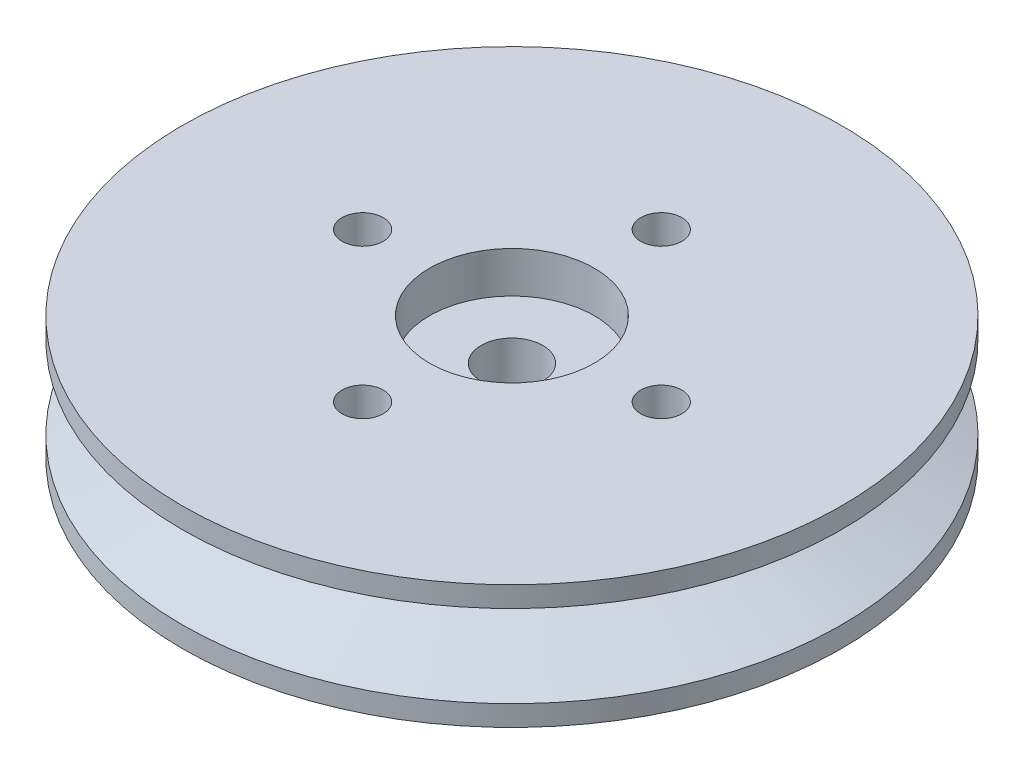
ISO-10303-21;
HEADER;
FILE_DESCRIPTION(('STEP AP214'),'2;1');
FILE_NAME('part.step','',(''),(''),'','','');
FILE_SCHEMA(('AUTOMOTIVE_DESIGN { 1 0 10303 214 1 1 1 1 }'));
ENDSEC;
DATA;
#1=APPLICATION_CONTEXT('core data for automotive mechanical design processes');
#2=APPLICATION_PROTOCOL_DEFINITION('international standard','automotive_design',2000,#1);
#3=PRODUCT_CONTEXT('',#1,'mechanical');
#4=PRODUCT('Part','Part','',(#3));
#5=PRODUCT_RELATED_PRODUCT_CATEGORY('part','',(#4));
#6=PRODUCT_DEFINITION_FORMATION('','',#4);
#7=PRODUCT_DEFINITION_CONTEXT('part definition',#1,'design');
#8=PRODUCT_DEFINITION('design','',#6,#7);
#9=PRODUCT_DEFINITION_SHAPE('','',#8);
#10=(LENGTH_UNIT() NAMED_UNIT(*) SI_UNIT(.MILLI.,.METRE.));
#11=(NAMED_UNIT(*) PLANE_ANGLE_UNIT() SI_UNIT($,.RADIAN.));
#12=(NAMED_UNIT(*) SI_UNIT($,.STERADIAN.) SOLID_ANGLE_UNIT());
#13=UNCERTAINTY_MEASURE_WITH_UNIT(LENGTH_MEASURE(1.E-05),#10,'distance_accuracy_value','');
#14=(GEOMETRIC_REPRESENTATION_CONTEXT(3) GLOBAL_UNCERTAINTY_ASSIGNED_CONTEXT((#13)) GLOBAL_UNIT_ASSIGNED_CONTEXT((#10,
#11,#12)) REPRESENTATION_CONTEXT('',''));
#15=CARTESIAN_POINT('',(0.,0.,0.));
#16=DIRECTION('',(0.,0.,1.));
#17=DIRECTION('',(1.,0.,0.));
#18=AXIS2_PLACEMENT_3D('',#15,#16,#17);
#19=CARTESIAN_POINT('',(0.,6.,0.));
#20=DIRECTION('',(0.,-1.,0.));
#21=DIRECTION('',(0.,0.,-1.));
#22=AXIS2_PLACEMENT_3D('',#19,#20,#21);
#23=CYLINDRICAL_SURFACE('',#22,16.);
#24=CARTESIAN_POINT('',(0.,5.,0.));
#25=DIRECTION('',(0.,1.,0.));
#26=DIRECTION('',(0.,0.,1.));
#27=AXIS2_PLACEMENT_3D('',#24,#25,#26);
#28=CIRCLE('',#27,16.);
#29=CARTESIAN_POINT('',(0.,5.,16.));
#30=VERTEX_POINT('',#29);
#31=EDGE_CURVE('E76',#30,#30,#28,.T.);
#32=ORIENTED_EDGE('',*,*,#31,.T.);
#33=EDGE_LOOP('',(#32));
#34=FACE_BOUND('',#33,.T.);
#35=CARTESIAN_POINT('',(0.,6.,0.));
#36=DIRECTION('',(0.,1.,0.));
#37=DIRECTION('',(0.,0.,1.));
#38=AXIS2_PLACEMENT_3D('',#35,#36,#37);
#39=CIRCLE('',#38,16.);
#40=CARTESIAN_POINT('',(0.,6.,16.));
#41=VERTEX_POINT('',#40);
#42=EDGE_CURVE('E10',#41,#41,#39,.T.);
#43=ORIENTED_EDGE('',*,*,#42,.F.);
#44=EDGE_LOOP('',(#43));
#45=FACE_BOUND('',#44,.T.);
#46=ADVANCED_FACE('F31',(#34,#45),#23,.T.);
#47=CARTESIAN_POINT('',(0.,6.,0.));
#48=DIRECTION('',(0.,-1.,0.));
#49=DIRECTION('',(0.,0.,-1.));
#50=AXIS2_PLACEMENT_3D('',#47,#48,#49);
#51=CYLINDRICAL_SURFACE('',#50,1.5);
#52=CARTESIAN_POINT('',(0.,0.,0.));
#53=DIRECTION('',(0.,1.,0.));
#54=DIRECTION('',(0.,0.,1.));
#55=AXIS2_PLACEMENT_3D('',#52,#53,#54);
#56=CIRCLE('',#55,1.5);
#57=CARTESIAN_POINT('',(0.,0.,1.5));
#58=VERTEX_POINT('',#57);
#59=EDGE_CURVE('E44',#58,#58,#56,.T.);
#60=ORIENTED_EDGE('',*,*,#59,.F.);
#61=EDGE_LOOP('',(#60));
#62=FACE_BOUND('',#61,.T.);
#63=CARTESIAN_POINT('',(0.,4.,0.));
#64=DIRECTION('',(0.,1.,0.));
#65=DIRECTION('',(0.,0.,1.));
#66=AXIS2_PLACEMENT_3D('',#63,#64,#65);
#67=CIRCLE('',#66,1.5);
#68=CARTESIAN_POINT('',(0.,4.,1.5));
#69=VERTEX_POINT('',#68);
#70=EDGE_CURVE('E35',#69,#69,#67,.T.);
#71=ORIENTED_EDGE('',*,*,#70,.T.);
#72=EDGE_LOOP('',(#71));
#73=FACE_BOUND('',#72,.T.);
#74=ADVANCED_FACE('F129',(#62,#73),#51,.F.);
#75=CARTESIAN_POINT('',(0.,6.,0.));
#76=DIRECTION('',(0.,1.,0.));
#77=DIRECTION('',(0.,0.,1.));
#78=AXIS2_PLACEMENT_3D('',#75,#76,#77);
#79=PLANE('',#78);
#80=CARTESIAN_POINT('',(0.,6.,0.));
#81=DIRECTION('',(0.,1.,0.));
#82=DIRECTION('',(0.,0.,1.));
#83=AXIS2_PLACEMENT_3D('',#80,#81,#82);
#84=CIRCLE('',#83,4.);
#85=CARTESIAN_POINT('',(0.,6.,4.));
#86=VERTEX_POINT('',#85);
#87=EDGE_CURVE('E72',#86,#86,#84,.T.);
#88=ORIENTED_EDGE('',*,*,#87,.F.);
#89=EDGE_LOOP('',(#88));
#90=FACE_BOUND('',#89,.T.);
#91=CARTESIAN_POINT('',(4.10339048882094E-13,6.,7.25));
#92=DIRECTION('',(0.,1.,0.));
#93=DIRECTION('',(0.,0.,1.));
#94=AXIS2_PLACEMENT_3D('',#91,#92,#93);
#95=CIRCLE('',#94,1.00000000000044);
#96=CARTESIAN_POINT('',(4.10339048882094E-13,6.,8.25000000000044));
#97=VERTEX_POINT('',#96);
#98=EDGE_CURVE('E58',#97,#97,#95,.T.);
#99=ORIENTED_EDGE('',*,*,#98,.F.);
#100=EDGE_LOOP('',(#99));
#101=FACE_BOUND('',#100,.T.);
#102=CARTESIAN_POINT('',(0.,6.,-7.25));
#103=DIRECTION('',(0.,1.,0.));
#104=DIRECTION('',(0.,0.,1.));
#105=AXIS2_PLACEMENT_3D('',#102,#103,#104);
#106=CIRCLE('',#105,1.);
#107=CARTESIAN_POINT('',(0.,6.,-6.25));
#108=VERTEX_POINT('',#107);
#109=EDGE_CURVE('E48',#108,#108,#106,.T.);
#110=ORIENTED_EDGE('',*,*,#109,.F.);
#111=EDGE_LOOP('',(#110));
#112=FACE_BOUND('',#111,.T.);
#113=ORIENTED_EDGE('',*,*,#42,.T.);
#114=EDGE_LOOP('',(#113));
#115=FACE_BOUND('',#114,.T.);
#116=CARTESIAN_POINT('',(7.25,6.,0.));
#117=DIRECTION('',(0.,1.,0.));
#118=DIRECTION('',(0.,0.,1.));
#119=AXIS2_PLACEMENT_3D('',#116,#117,#118);
#120=CIRCLE('',#119,1.);
#121=CARTESIAN_POINT('',(7.25,6.,1.00000000000003));
#122=VERTEX_POINT('',#121);
#123=EDGE_CURVE('E52',#122,#122,#120,.T.);
#124=ORIENTED_EDGE('',*,*,#123,.F.);
#125=EDGE_LOOP('',(#124));
#126=FACE_BOUND('',#125,.T.);
#127=CARTESIAN_POINT('',(-7.2499999999998,6.,2.06057393370429E-13));
#128=DIRECTION('',(0.,1.,0.));
#129=DIRECTION('',(0.,0.,1.));
#130=AXIS2_PLACEMENT_3D('',#127,#128,#129);
#131=CIRCLE('',#130,1.00000000000033);
#132=CARTESIAN_POINT('',(-7.2499999999998,6.,1.00000000000054));
#133=VERTEX_POINT('',#132);
#134=EDGE_CURVE('E64',#133,#133,#131,.T.);
#135=ORIENTED_EDGE('',*,*,#134,.F.);
#136=EDGE_LOOP('',(#135));
#137=FACE_BOUND('',#136,.T.);
#138=ADVANCED_FACE('F101',(#90,#101,#112,#115,#126,#137),#79,.T.);
#139=CARTESIAN_POINT('',(0.,0.,0.));
#140=DIRECTION('',(0.,1.,0.));
#141=DIRECTION('',(0.,0.,1.));
#142=AXIS2_PLACEMENT_3D('',#139,#140,#141);
#143=PLANE('',#142);
#144=CARTESIAN_POINT('',(0.,0.,0.));
#145=DIRECTION('',(0.,1.,0.));
#146=DIRECTION('',(0.,0.,1.));
#147=AXIS2_PLACEMENT_3D('',#144,#145,#146);
#148=CIRCLE('',#147,16.);
#149=CARTESIAN_POINT('',(0.,0.,16.));
#150=VERTEX_POINT('',#149);
#151=EDGE_CURVE('E39',#150,#150,#148,.T.);
#152=ORIENTED_EDGE('',*,*,#151,.F.);
#153=EDGE_LOOP('',(#152));
#154=FACE_BOUND('',#153,.T.);
#155=ORIENTED_EDGE('',*,*,#59,.T.);
#156=EDGE_LOOP('',(#155));
#157=FACE_BOUND('',#156,.T.);
#158=CARTESIAN_POINT('',(0.,0.,-7.25));
#159=DIRECTION('',(0.,1.,0.));
#160=DIRECTION('',(0.,0.,1.));
#161=AXIS2_PLACEMENT_3D('',#158,#159,#160);
#162=CIRCLE('',#161,1.);
#163=CARTESIAN_POINT('',(0.,0.,-6.25));
#164=VERTEX_POINT('',#163);
#165=EDGE_CURVE('E49',#164,#164,#162,.T.);
#166=ORIENTED_EDGE('',*,*,#165,.T.);
#167=EDGE_LOOP('',(#166));
#168=FACE_BOUND('',#167,.T.);
#169=CARTESIAN_POINT('',(7.25,0.,0.));
#170=DIRECTION('',(0.,1.,0.));
#171=DIRECTION('',(0.,0.,1.));
#172=AXIS2_PLACEMENT_3D('',#169,#170,#171);
#173=CIRCLE('',#172,1.);
#174=CARTESIAN_POINT('',(7.25,0.,1.00000000000003));
#175=VERTEX_POINT('',#174);
#176=EDGE_CURVE('E55',#175,#175,#173,.T.);
#177=ORIENTED_EDGE('',*,*,#176,.T.);
#178=EDGE_LOOP('',(#177));
#179=FACE_BOUND('',#178,.T.);
#180=CARTESIAN_POINT('',(4.10339048882094E-13,0.,7.25));
#181=DIRECTION('',(0.,1.,0.));
#182=DIRECTION('',(0.,0.,1.));
#183=AXIS2_PLACEMENT_3D('',#180,#181,#182);
#184=CIRCLE('',#183,1.00000000000044);
#185=CARTESIAN_POINT('',(4.10339048882094E-13,0.,8.25000000000044));
#186=VERTEX_POINT('',#185);
#187=EDGE_CURVE('E61',#186,#186,#184,.T.);
#188=ORIENTED_EDGE('',*,*,#187,.T.);
#189=EDGE_LOOP('',(#188));
#190=FACE_BOUND('',#189,.T.);
#191=CARTESIAN_POINT('',(-7.2499999999998,0.,2.06057393370429E-13));
#192=DIRECTION('',(0.,1.,0.));
#193=DIRECTION('',(0.,0.,1.));
#194=AXIS2_PLACEMENT_3D('',#191,#192,#193);
#195=CIRCLE('',#194,1.00000000000033);
#196=CARTESIAN_POINT('',(-7.2499999999998,0.,1.00000000000054));
#197=VERTEX_POINT('',#196);
#198=EDGE_CURVE('E67',#197,#197,#195,.T.);
#199=ORIENTED_EDGE('',*,*,#198,.T.);
#200=EDGE_LOOP('',(#199));
#201=FACE_BOUND('',#200,.T.);
#202=ADVANCED_FACE('F96',(#154,#157,#168,#179,#190,#201),#143,.F.);
#203=CARTESIAN_POINT('',(0.,1.,0.));
#204=DIRECTION('',(0.,1.,0.));
#205=DIRECTION('',(0.,0.,1.));
#206=AXIS2_PLACEMENT_3D('',#203,#204,#205);
#207=CIRCLE('',#206,16.);
#208=CARTESIAN_POINT('',(0.,1.,16.));
#209=VERTEX_POINT('',#208);
#210=EDGE_CURVE('E87',#209,#209,#207,.T.);
#211=ORIENTED_EDGE('',*,*,#210,.F.);
#212=EDGE_LOOP('',(#211));
#213=FACE_BOUND('',#212,.T.);
#214=ORIENTED_EDGE('',*,*,#151,.T.);
#215=EDGE_LOOP('',(#214));
#216=FACE_BOUND('',#215,.T.);
#217=ADVANCED_FACE('F33',(#213,#216),#23,.T.);
#218=CARTESIAN_POINT('',(0.,6.,-7.25));
#219=DIRECTION('',(0.,-1.,0.));
#220=DIRECTION('',(0.,0.,-1.));
#221=AXIS2_PLACEMENT_3D('',#218,#219,#220);
#222=CYLINDRICAL_SURFACE('',#221,1.);
#223=ORIENTED_EDGE('',*,*,#109,.T.);
#224=EDGE_LOOP('',(#223));
#225=FACE_BOUND('',#224,.T.);
#226=ORIENTED_EDGE('',*,*,#165,.F.);
#227=EDGE_LOOP('',(#226));
#228=FACE_BOUND('',#227,.T.);
#229=ADVANCED_FACE('F95',(#225,#228),#222,.F.);
#230=CARTESIAN_POINT('',(7.25,6.,0.));
#231=DIRECTION('',(0.,-1.,0.));
#232=DIRECTION('',(0.,0.,-1.));
#233=AXIS2_PLACEMENT_3D('',#230,#231,#232);
#234=CYLINDRICAL_SURFACE('',#233,1.);
#235=ORIENTED_EDGE('',*,*,#123,.T.);
#236=EDGE_LOOP('',(#235));
#237=FACE_BOUND('',#236,.T.);
#238=ORIENTED_EDGE('',*,*,#176,.F.);
#239=EDGE_LOOP('',(#238));
#240=FACE_BOUND('',#239,.T.);
#241=ADVANCED_FACE('F125',(#237,#240),#234,.F.);
#242=CARTESIAN_POINT('',(4.10339048882094E-13,6.,7.25));
#243=DIRECTION('',(0.,-1.,0.));
#244=DIRECTION('',(0.,0.,-1.));
#245=AXIS2_PLACEMENT_3D('',#242,#243,#244);
#246=CYLINDRICAL_SURFACE('',#245,1.00000000000044);
#247=ORIENTED_EDGE('',*,*,#98,.T.);
#248=EDGE_LOOP('',(#247));
#249=FACE_BOUND('',#248,.T.);
#250=ORIENTED_EDGE('',*,*,#187,.F.);
#251=EDGE_LOOP('',(#250));
#252=FACE_BOUND('',#251,.T.);
#253=ADVANCED_FACE('F115',(#249,#252),#246,.F.);
#254=CARTESIAN_POINT('',(-7.2499999999998,6.,2.06057393370429E-13));
#255=DIRECTION('',(0.,-1.,0.));
#256=DIRECTION('',(0.,0.,-1.));
#257=AXIS2_PLACEMENT_3D('',#254,#255,#256);
#258=CYLINDRICAL_SURFACE('',#257,1.00000000000033);
#259=ORIENTED_EDGE('',*,*,#134,.T.);
#260=EDGE_LOOP('',(#259));
#261=FACE_BOUND('',#260,.T.);
#262=ORIENTED_EDGE('',*,*,#198,.F.);
#263=EDGE_LOOP('',(#262));
#264=FACE_BOUND('',#263,.T.);
#265=ADVANCED_FACE('F112',(#261,#264),#258,.F.);
#266=CARTESIAN_POINT('',(0.,4.,0.));
#267=DIRECTION('',(0.,1.,0.));
#268=DIRECTION('',(0.,0.,1.));
#269=AXIS2_PLACEMENT_3D('',#266,#267,#268);
#270=CYLINDRICAL_SURFACE('',#269,4.);
#271=CARTESIAN_POINT('',(0.,4.,0.));
#272=DIRECTION('',(0.,1.,0.));
#273=DIRECTION('',(0.,0.,1.));
#274=AXIS2_PLACEMENT_3D('',#271,#272,#273);
#275=CIRCLE('',#274,4.);
#276=CARTESIAN_POINT('',(0.,4.,4.));
#277=VERTEX_POINT('',#276);
#278=EDGE_CURVE('E75',#277,#277,#275,.T.);
#279=ORIENTED_EDGE('',*,*,#278,.F.);
#280=EDGE_LOOP('',(#279));
#281=FACE_BOUND('',#280,.T.);
#282=ORIENTED_EDGE('',*,*,#87,.T.);
#283=EDGE_LOOP('',(#282));
#284=FACE_BOUND('',#283,.T.);
#285=ADVANCED_FACE('F114',(#281,#284),#270,.F.);
#286=CARTESIAN_POINT('',(0.,4.,0.));
#287=DIRECTION('',(0.,1.,0.));
#288=DIRECTION('',(0.,0.,1.));
#289=AXIS2_PLACEMENT_3D('',#286,#287,#288);
#290=PLANE('',#289);
#291=ORIENTED_EDGE('',*,*,#70,.F.);
#292=EDGE_LOOP('',(#291));
#293=FACE_BOUND('',#292,.T.);
#294=ORIENTED_EDGE('',*,*,#278,.T.);
#295=EDGE_LOOP('',(#294));
#296=FACE_BOUND('',#295,.T.);
#297=ADVANCED_FACE('F122',(#293,#296),#290,.T.);
#298=CARTESIAN_POINT('',(0.,3.5,0.));
#299=DIRECTION('',(0.,1.,0.));
#300=DIRECTION('',(0.,0.,1.));
#301=AXIS2_PLACEMENT_3D('',#298,#299,#300);
#302=CONICAL_SURFACE('',#301,12.,1.21202565652432);
#303=ORIENTED_EDGE('',*,*,#31,.F.);
#304=EDGE_LOOP('',(#303));
#305=FACE_BOUND('',#304,.T.);
#306=CARTESIAN_POINT('',(0.,3.5,0.));
#307=DIRECTION('',(0.,1.,0.));
#308=DIRECTION('',(0.,0.,1.));
#309=AXIS2_PLACEMENT_3D('',#306,#307,#308);
#310=CIRCLE('',#309,12.);
#311=CARTESIAN_POINT('',(0.,3.5,12.));
#312=VERTEX_POINT('',#311);
#313=EDGE_CURVE('E81',#312,#312,#310,.T.);
#314=ORIENTED_EDGE('',*,*,#313,.T.);
#315=EDGE_LOOP('',(#314));
#316=FACE_BOUND('',#315,.T.);
#317=ADVANCED_FACE('F139',(#305,#316),#302,.T.);
#318=CARTESIAN_POINT('',(0.,6.,0.));
#319=DIRECTION('',(0.,1.,0.));
#320=DIRECTION('',(0.,0.,1.));
#321=AXIS2_PLACEMENT_3D('',#318,#319,#320);
#322=CYLINDRICAL_SURFACE('',#321,12.);
#323=ORIENTED_EDGE('',*,*,#313,.F.);
#324=EDGE_LOOP('',(#323));
#325=FACE_BOUND('',#324,.T.);
#326=CARTESIAN_POINT('',(0.,2.5,0.));
#327=DIRECTION('',(0.,1.,0.));
#328=DIRECTION('',(0.,0.,1.));
#329=AXIS2_PLACEMENT_3D('',#326,#327,#328);
#330=CIRCLE('',#329,12.);
#331=CARTESIAN_POINT('',(0.,2.5,12.));
#332=VERTEX_POINT('',#331);
#333=EDGE_CURVE('E84',#332,#332,#330,.T.);
#334=ORIENTED_EDGE('',*,*,#333,.T.);
#335=EDGE_LOOP('',(#334));
#336=FACE_BOUND('',#335,.T.);
#337=ADVANCED_FACE('F142',(#325,#336),#322,.T.);
#338=CARTESIAN_POINT('',(0.,1.,0.));
#339=DIRECTION('',(0.,-1.,0.));
#340=DIRECTION('',(0.,0.,-1.));
#341=AXIS2_PLACEMENT_3D('',#338,#339,#340);
#342=CONICAL_SURFACE('',#341,16.,1.21202565652432);
#343=ORIENTED_EDGE('',*,*,#333,.F.);
#344=EDGE_LOOP('',(#343));
#345=FACE_BOUND('',#344,.T.);
#346=ORIENTED_EDGE('',*,*,#210,.T.);
#347=EDGE_LOOP('',(#346));
#348=FACE_BOUND('',#347,.T.);
#349=ADVANCED_FACE('F91',(#345,#348),#342,.T.);
#350=CLOSED_SHELL('',(#46,#74,#138,#202,#217,#229,#241,#253,#265,#285,#297,#317,#337,#349));
#351=MANIFOLD_SOLID_BREP('B2',#350);
#352=ADVANCED_BREP_SHAPE_REPRESENTATION('',(#18,#351),#14);
#353=SHAPE_DEFINITION_REPRESENTATION(#9,#352);
ENDSEC;
END-ISO-10303-21;
